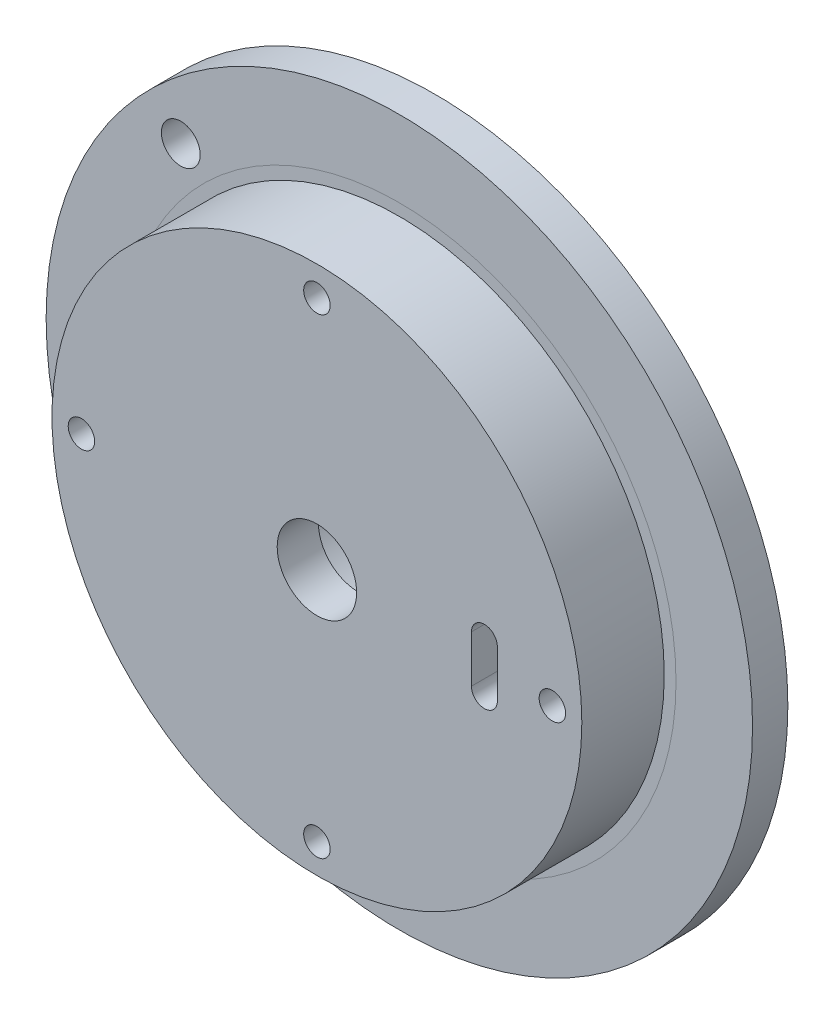
ISO-10303-21;
HEADER;
FILE_DESCRIPTION(('STEP AP214'),'2;1');
FILE_NAME('part.step','',(''),(''),'','','');
FILE_SCHEMA(('AUTOMOTIVE_DESIGN { 1 0 10303 214 1 1 1 1 }'));
ENDSEC;
DATA;
#1=APPLICATION_CONTEXT('core data for automotive mechanical design processes');
#2=APPLICATION_PROTOCOL_DEFINITION('international standard','automotive_design',2000,#1);
#3=PRODUCT_CONTEXT('',#1,'mechanical');
#4=PRODUCT('Part','Part','',(#3));
#5=PRODUCT_RELATED_PRODUCT_CATEGORY('part','',(#4));
#6=PRODUCT_DEFINITION_FORMATION('','',#4);
#7=PRODUCT_DEFINITION_CONTEXT('part definition',#1,'design');
#8=PRODUCT_DEFINITION('design','',#6,#7);
#9=PRODUCT_DEFINITION_SHAPE('','',#8);
#10=(LENGTH_UNIT() NAMED_UNIT(*) SI_UNIT(.MILLI.,.METRE.));
#11=(NAMED_UNIT(*) PLANE_ANGLE_UNIT() SI_UNIT($,.RADIAN.));
#12=(NAMED_UNIT(*) SI_UNIT($,.STERADIAN.) SOLID_ANGLE_UNIT());
#13=UNCERTAINTY_MEASURE_WITH_UNIT(LENGTH_MEASURE(1.E-05),#10,'distance_accuracy_value','');
#14=(GEOMETRIC_REPRESENTATION_CONTEXT(3) GLOBAL_UNCERTAINTY_ASSIGNED_CONTEXT((#13)) GLOBAL_UNIT_ASSIGNED_CONTEXT((#10,
#11,#12)) REPRESENTATION_CONTEXT('',''));
#15=CARTESIAN_POINT('',(0.,0.,0.));
#16=DIRECTION('',(0.,0.,1.));
#17=DIRECTION('',(1.,0.,0.));
#18=AXIS2_PLACEMENT_3D('',#15,#16,#17);
#19=CARTESIAN_POINT('',(0.,0.,13.));
#20=DIRECTION('',(0.,0.,-1.));
#21=DIRECTION('',(-1.,0.,0.));
#22=AXIS2_PLACEMENT_3D('',#19,#20,#21);
#23=PLANE('',#22);
#24=CARTESIAN_POINT('',(0.,0.,13.));
#25=DIRECTION('',(0.,0.,-1.));
#26=DIRECTION('',(-1.,0.,0.));
#27=AXIS2_PLACEMENT_3D('',#24,#25,#26);
#28=CIRCLE('',#27,14.);
#29=CARTESIAN_POINT('',(-14.,0.,13.));
#30=VERTEX_POINT('',#29);
#31=EDGE_CURVE('E123',#30,#30,#28,.T.);
#32=ORIENTED_EDGE('',*,*,#31,.T.);
#33=EDGE_LOOP('',(#32));
#34=FACE_BOUND('',#33,.T.);
#35=CARTESIAN_POINT('',(0.,0.,13.));
#36=DIRECTION('',(0.,0.,-1.));
#37=DIRECTION('',(-1.,0.,0.));
#38=AXIS2_PLACEMENT_3D('',#35,#36,#37);
#39=CIRCLE('',#38,13.5);
#40=CARTESIAN_POINT('',(-13.5,0.,13.));
#41=VERTEX_POINT('',#40);
#42=EDGE_CURVE('E249',#41,#41,#39,.F.);
#43=ORIENTED_EDGE('',*,*,#42,.T.);
#44=EDGE_LOOP('',(#43));
#45=FACE_BOUND('',#44,.T.);
#46=ADVANCED_FACE('F115',(#34,#45),#23,.T.);
#47=CARTESIAN_POINT('',(0.,0.,6.));
#48=DIRECTION('',(0.,0.,1.));
#49=DIRECTION('',(1.,0.,0.));
#50=AXIS2_PLACEMENT_3D('',#47,#48,#49);
#51=PLANE('',#50);
#52=CARTESIAN_POINT('',(0.,0.,6.));
#53=DIRECTION('',(0.,0.,1.));
#54=DIRECTION('',(1.,0.,0.));
#55=AXIS2_PLACEMENT_3D('',#52,#53,#54);
#56=CIRCLE('',#55,60.);
#57=CARTESIAN_POINT('',(60.,0.,6.));
#58=VERTEX_POINT('',#57);
#59=EDGE_CURVE('E229',#58,#58,#56,.T.);
#60=ORIENTED_EDGE('',*,*,#59,.T.);
#61=EDGE_LOOP('',(#60));
#62=FACE_BOUND('',#61,.T.);
#63=CARTESIAN_POINT('',(-37.1231060122937,37.1231060122937,6.));
#64=DIRECTION('',(0.,0.,1.));
#65=DIRECTION('',(1.,0.,0.));
#66=AXIS2_PLACEMENT_3D('',#63,#64,#65);
#67=CIRCLE('',#66,3.29999999999998);
#68=CARTESIAN_POINT('',(-33.8231060122938,37.1231060122937,6.));
#69=VERTEX_POINT('',#68);
#70=EDGE_CURVE('E396',#69,#69,#67,.T.);
#71=ORIENTED_EDGE('',*,*,#70,.F.);
#72=EDGE_LOOP('',(#71));
#73=FACE_BOUND('',#72,.T.);
#74=CARTESIAN_POINT('',(0.,0.,6.));
#75=DIRECTION('',(0.,0.,1.));
#76=DIRECTION('',(1.,0.,0.));
#77=AXIS2_PLACEMENT_3D('',#74,#75,#76);
#78=CIRCLE('',#77,47.);
#79=CARTESIAN_POINT('',(47.,0.,6.));
#80=VERTEX_POINT('',#79);
#81=EDGE_CURVE('E245',#80,#80,#78,.F.);
#82=ORIENTED_EDGE('',*,*,#81,.T.);
#83=EDGE_LOOP('',(#82));
#84=FACE_BOUND('',#83,.T.);
#85=ADVANCED_FACE('F268',(#62,#73,#84),#51,.T.);
#86=CARTESIAN_POINT('',(0.,0.,0.));
#87=DIRECTION('',(0.,0.,-1.));
#88=DIRECTION('',(-1.,0.,0.));
#89=AXIS2_PLACEMENT_3D('',#86,#87,#88);
#90=CYLINDRICAL_SURFACE('',#89,6.75);
#91=CARTESIAN_POINT('',(0.,0.,20.));
#92=DIRECTION('',(0.,0.,-1.));
#93=DIRECTION('',(-1.,0.,0.));
#94=AXIS2_PLACEMENT_3D('',#91,#92,#93);
#95=CIRCLE('',#94,6.75);
#96=CARTESIAN_POINT('',(-6.75,0.,20.));
#97=VERTEX_POINT('',#96);
#98=EDGE_CURVE('E238',#97,#97,#95,.T.);
#99=ORIENTED_EDGE('',*,*,#98,.F.);
#100=EDGE_LOOP('',(#99));
#101=FACE_BOUND('',#100,.T.);
#102=CARTESIAN_POINT('',(0.,0.,13.));
#103=DIRECTION('',(0.,0.,-1.));
#104=DIRECTION('',(-1.,0.,0.));
#105=AXIS2_PLACEMENT_3D('',#102,#103,#104);
#106=CIRCLE('',#105,6.75);
#107=CARTESIAN_POINT('',(-6.75,0.,13.));
#108=VERTEX_POINT('',#107);
#109=EDGE_CURVE('E235',#108,#108,#106,.F.);
#110=ORIENTED_EDGE('',*,*,#109,.F.);
#111=EDGE_LOOP('',(#110));
#112=FACE_BOUND('',#111,.T.);
#113=ADVANCED_FACE('F274',(#101,#112),#90,.F.);
#114=CARTESIAN_POINT('',(0.,0.,20.));
#115=DIRECTION('',(0.,0.,1.));
#116=DIRECTION('',(1.,0.,0.));
#117=AXIS2_PLACEMENT_3D('',#114,#115,#116);
#118=PLANE('',#117);
#119=ORIENTED_EDGE('',*,*,#98,.T.);
#120=EDGE_LOOP('',(#119));
#121=FACE_BOUND('',#120,.T.);
#122=CARTESIAN_POINT('',(0.,40.,20.));
#123=DIRECTION('',(0.,0.,-1.));
#124=DIRECTION('',(-1.,0.,0.));
#125=AXIS2_PLACEMENT_3D('',#122,#123,#124);
#126=CIRCLE('',#125,2.25);
#127=CARTESIAN_POINT('',(-2.25,40.,20.));
#128=VERTEX_POINT('',#127);
#129=EDGE_CURVE('E192',#128,#128,#126,.T.);
#130=ORIENTED_EDGE('',*,*,#129,.T.);
#131=EDGE_LOOP('',(#130));
#132=FACE_BOUND('',#131,.T.);
#133=CARTESIAN_POINT('',(-40.,0.,20.));
#134=DIRECTION('',(0.,0.,-1.));
#135=DIRECTION('',(-1.,0.,0.));
#136=AXIS2_PLACEMENT_3D('',#133,#134,#135);
#137=CIRCLE('',#136,2.25);
#138=CARTESIAN_POINT('',(-42.25,0.,20.));
#139=VERTEX_POINT('',#138);
#140=EDGE_CURVE('E201',#139,#139,#137,.T.);
#141=ORIENTED_EDGE('',*,*,#140,.T.);
#142=EDGE_LOOP('',(#141));
#143=FACE_BOUND('',#142,.T.);
#144=CARTESIAN_POINT('',(0.,-40.,20.));
#145=DIRECTION('',(0.,0.,-1.));
#146=DIRECTION('',(-1.,0.,0.));
#147=AXIS2_PLACEMENT_3D('',#144,#145,#146);
#148=CIRCLE('',#147,2.25);
#149=CARTESIAN_POINT('',(-2.25,-40.,20.));
#150=VERTEX_POINT('',#149);
#151=EDGE_CURVE('E210',#150,#150,#148,.T.);
#152=ORIENTED_EDGE('',*,*,#151,.T.);
#153=EDGE_LOOP('',(#152));
#154=FACE_BOUND('',#153,.T.);
#155=CARTESIAN_POINT('',(40.,0.,20.));
#156=DIRECTION('',(0.,0.,-1.));
#157=DIRECTION('',(-1.,0.,0.));
#158=AXIS2_PLACEMENT_3D('',#155,#156,#157);
#159=CIRCLE('',#158,2.25);
#160=CARTESIAN_POINT('',(37.75,0.,20.));
#161=VERTEX_POINT('',#160);
#162=EDGE_CURVE('E219',#161,#161,#159,.T.);
#163=ORIENTED_EDGE('',*,*,#162,.T.);
#164=EDGE_LOOP('',(#163));
#165=FACE_BOUND('',#164,.T.);
#166=CARTESIAN_POINT('',(0.,0.,20.));
#167=DIRECTION('',(0.,0.,1.));
#168=DIRECTION('',(1.,0.,0.));
#169=AXIS2_PLACEMENT_3D('',#166,#167,#168);
#170=CIRCLE('',#169,45.);
#171=CARTESIAN_POINT('',(45.,0.,20.));
#172=VERTEX_POINT('',#171);
#173=EDGE_CURVE('E222',#172,#172,#170,.T.);
#174=ORIENTED_EDGE('',*,*,#173,.T.);
#175=EDGE_LOOP('',(#174));
#176=FACE_BOUND('',#175,.T.);
#177=DIRECTION('',(0.,1.,0.));
#178=VECTOR('',#177,1.);
#179=CARTESIAN_POINT('',(26.2506410802858,-4.,20.));
#180=LINE('',#179,#178);
#181=CARTESIAN_POINT('',(26.2506410802858,-4.,20.));
#182=VERTEX_POINT('',#181);
#183=CARTESIAN_POINT('',(26.2506410802858,4.,20.));
#184=VERTEX_POINT('',#183);
#185=EDGE_CURVE('E154',#182,#184,#180,.T.);
#186=ORIENTED_EDGE('',*,*,#185,.T.);
#187=CARTESIAN_POINT('',(28.4506410802858,4.,20.));
#188=DIRECTION('',(0.,0.,-1.));
#189=DIRECTION('',(-1.,0.,0.));
#190=AXIS2_PLACEMENT_3D('',#187,#188,#189);
#191=CIRCLE('',#190,2.19999999999999);
#192=CARTESIAN_POINT('',(30.6506410802858,4.,20.));
#193=VERTEX_POINT('',#192);
#194=EDGE_CURVE('E183',#184,#193,#191,.T.);
#195=ORIENTED_EDGE('',*,*,#194,.T.);
#196=DIRECTION('',(0.,1.,0.));
#197=VECTOR('',#196,1.);
#198=CARTESIAN_POINT('',(30.6506410802858,-4.,20.));
#199=LINE('',#198,#197);
#200=CARTESIAN_POINT('',(30.6506410802858,-4.,20.));
#201=VERTEX_POINT('',#200);
#202=EDGE_CURVE('E164',#201,#193,#199,.T.);
#203=ORIENTED_EDGE('',*,*,#202,.F.);
#204=CARTESIAN_POINT('',(28.4506410802858,-4.,20.));
#205=DIRECTION('',(0.,0.,-1.));
#206=DIRECTION('',(-1.,0.,0.));
#207=AXIS2_PLACEMENT_3D('',#204,#205,#206);
#208=CIRCLE('',#207,2.19999999999999);
#209=EDGE_CURVE('E168',#201,#182,#208,.T.);
#210=ORIENTED_EDGE('',*,*,#209,.T.);
#211=EDGE_LOOP('',(#186,#195,#203,#210));
#212=FACE_BOUND('',#211,.T.);
#213=ADVANCED_FACE('F175',(#121,#132,#143,#154,#165,#176,#212),#118,.T.);
#214=CARTESIAN_POINT('',(0.,0.,6.));
#215=DIRECTION('',(0.,0.,-1.));
#216=DIRECTION('',(-1.,0.,0.));
#217=AXIS2_PLACEMENT_3D('',#214,#215,#216);
#218=CYLINDRICAL_SURFACE('',#217,60.);
#219=CARTESIAN_POINT('',(0.,0.,0.));
#220=DIRECTION('',(0.,0.,1.));
#221=DIRECTION('',(1.,0.,0.));
#222=AXIS2_PLACEMENT_3D('',#219,#220,#221);
#223=CIRCLE('',#222,60.);
#224=CARTESIAN_POINT('',(60.,0.,0.));
#225=VERTEX_POINT('',#224);
#226=EDGE_CURVE('E228',#225,#225,#223,.T.);
#227=ORIENTED_EDGE('',*,*,#226,.T.);
#228=EDGE_LOOP('',(#227));
#229=FACE_BOUND('',#228,.T.);
#230=ORIENTED_EDGE('',*,*,#59,.F.);
#231=EDGE_LOOP('',(#230));
#232=FACE_BOUND('',#231,.T.);
#233=ADVANCED_FACE('F302',(#229,#232),#218,.T.);
#234=ORIENTED_EDGE('',*,*,#81,.F.);
#235=EDGE_LOOP('',(#234));
#236=FACE_BOUND('',#235,.T.);
#237=CARTESIAN_POINT('',(0.,0.,6.));
#238=DIRECTION('',(0.,0.,1.));
#239=DIRECTION('',(1.,0.,0.));
#240=AXIS2_PLACEMENT_3D('',#237,#238,#239);
#241=CIRCLE('',#240,45.);
#242=CARTESIAN_POINT('',(45.,0.,6.));
#243=VERTEX_POINT('',#242);
#244=EDGE_CURVE('E225',#243,#243,#241,.F.);
#245=ORIENTED_EDGE('',*,*,#244,.T.);
#246=EDGE_LOOP('',(#245));
#247=FACE_BOUND('',#246,.T.);
#248=ADVANCED_FACE('F277',(#236,#247),#51,.T.);
#249=CARTESIAN_POINT('',(0.,0.,0.));
#250=DIRECTION('',(0.,0.,1.));
#251=DIRECTION('',(1.,0.,0.));
#252=AXIS2_PLACEMENT_3D('',#249,#250,#251);
#253=PLANE('',#252);
#254=CARTESIAN_POINT('',(-23.6415128294988,-24.9493401738382,0.));
#255=DIRECTION('',(0.,0.,1.));
#256=DIRECTION('',(1.,0.,0.));
#257=AXIS2_PLACEMENT_3D('',#254,#255,#256);
#258=CIRCLE('',#257,5.);
#259=CARTESIAN_POINT('',(-18.6415128294988,-24.9493401738382,0.));
#260=VERTEX_POINT('',#259);
#261=EDGE_CURVE('E239',#260,#260,#258,.T.);
#262=ORIENTED_EDGE('',*,*,#261,.T.);
#263=EDGE_LOOP('',(#262));
#264=FACE_BOUND('',#263,.T.);
#265=CARTESIAN_POINT('',(0.,0.,0.));
#266=DIRECTION('',(0.,0.,1.));
#267=DIRECTION('',(1.,0.,0.));
#268=AXIS2_PLACEMENT_3D('',#265,#266,#267);
#269=CIRCLE('',#268,18.);
#270=CARTESIAN_POINT('',(18.,0.,0.));
#271=VERTEX_POINT('',#270);
#272=EDGE_CURVE('E242',#271,#271,#269,.T.);
#273=ORIENTED_EDGE('',*,*,#272,.T.);
#274=EDGE_LOOP('',(#273));
#275=FACE_BOUND('',#274,.T.);
#276=CARTESIAN_POINT('',(-37.1231060122937,37.1231060122937,0.));
#277=DIRECTION('',(0.,0.,1.));
#278=DIRECTION('',(1.,0.,0.));
#279=AXIS2_PLACEMENT_3D('',#276,#277,#278);
#280=CIRCLE('',#279,3.3);
#281=CARTESIAN_POINT('',(-33.8231060122937,37.1231060122937,0.));
#282=VERTEX_POINT('',#281);
#283=EDGE_CURVE('E377',#282,#282,#280,.T.);
#284=ORIENTED_EDGE('',*,*,#283,.T.);
#285=EDGE_LOOP('',(#284));
#286=FACE_BOUND('',#285,.T.);
#287=CARTESIAN_POINT('',(28.4506410802858,4.,0.));
#288=DIRECTION('',(0.,0.,-1.));
#289=DIRECTION('',(-1.,0.,0.));
#290=AXIS2_PLACEMENT_3D('',#287,#288,#289);
#291=CIRCLE('',#290,2.19999999999999);
#292=CARTESIAN_POINT('',(26.2506410802858,4.,0.));
#293=VERTEX_POINT('',#292);
#294=CARTESIAN_POINT('',(30.6506410802858,4.,0.));
#295=VERTEX_POINT('',#294);
#296=EDGE_CURVE('E181',#293,#295,#291,.T.);
#297=ORIENTED_EDGE('',*,*,#296,.F.);
#298=DIRECTION('',(0.,1.,0.));
#299=VECTOR('',#298,1.);
#300=CARTESIAN_POINT('',(26.2506410802858,-4.,0.));
#301=LINE('',#300,#299);
#302=CARTESIAN_POINT('',(26.2506410802858,-4.,0.));
#303=VERTEX_POINT('',#302);
#304=EDGE_CURVE('E165',#303,#293,#301,.T.);
#305=ORIENTED_EDGE('',*,*,#304,.F.);
#306=CARTESIAN_POINT('',(28.4506410802858,-4.,0.));
#307=DIRECTION('',(0.,0.,-1.));
#308=DIRECTION('',(-1.,0.,0.));
#309=AXIS2_PLACEMENT_3D('',#306,#307,#308);
#310=CIRCLE('',#309,2.19999999999999);
#311=CARTESIAN_POINT('',(30.6506410802858,-4.,0.));
#312=VERTEX_POINT('',#311);
#313=EDGE_CURVE('E171',#312,#303,#310,.T.);
#314=ORIENTED_EDGE('',*,*,#313,.F.);
#315=DIRECTION('',(0.,1.,0.));
#316=VECTOR('',#315,1.);
#317=CARTESIAN_POINT('',(30.6506410802858,-4.,0.));
#318=LINE('',#317,#316);
#319=EDGE_CURVE('E412',#312,#295,#318,.T.);
#320=ORIENTED_EDGE('',*,*,#319,.T.);
#321=EDGE_LOOP('',(#297,#305,#314,#320));
#322=FACE_BOUND('',#321,.T.);
#323=CARTESIAN_POINT('',(0.,40.,0.));
#324=DIRECTION('',(0.,0.,-1.));
#325=DIRECTION('',(-1.,0.,0.));
#326=AXIS2_PLACEMENT_3D('',#323,#324,#325);
#327=CIRCLE('',#326,2.425);
#328=CARTESIAN_POINT('',(-2.425,40.,0.));
#329=VERTEX_POINT('',#328);
#330=EDGE_CURVE('E186',#329,#329,#327,.T.);
#331=ORIENTED_EDGE('',*,*,#330,.F.);
#332=EDGE_LOOP('',(#331));
#333=FACE_BOUND('',#332,.T.);
#334=CARTESIAN_POINT('',(-40.,0.,0.));
#335=DIRECTION('',(0.,0.,-1.));
#336=DIRECTION('',(-1.,0.,0.));
#337=AXIS2_PLACEMENT_3D('',#334,#335,#336);
#338=CIRCLE('',#337,2.425);
#339=CARTESIAN_POINT('',(-42.425,0.,0.));
#340=VERTEX_POINT('',#339);
#341=EDGE_CURVE('E195',#340,#340,#338,.T.);
#342=ORIENTED_EDGE('',*,*,#341,.F.);
#343=EDGE_LOOP('',(#342));
#344=FACE_BOUND('',#343,.T.);
#345=CARTESIAN_POINT('',(0.,-40.,0.));
#346=DIRECTION('',(0.,0.,-1.));
#347=DIRECTION('',(-1.,0.,0.));
#348=AXIS2_PLACEMENT_3D('',#345,#346,#347);
#349=CIRCLE('',#348,2.425);
#350=CARTESIAN_POINT('',(-2.425,-40.,0.));
#351=VERTEX_POINT('',#350);
#352=EDGE_CURVE('E204',#351,#351,#349,.T.);
#353=ORIENTED_EDGE('',*,*,#352,.F.);
#354=EDGE_LOOP('',(#353));
#355=FACE_BOUND('',#354,.T.);
#356=CARTESIAN_POINT('',(40.,0.,0.));
#357=DIRECTION('',(0.,0.,-1.));
#358=DIRECTION('',(-1.,0.,0.));
#359=AXIS2_PLACEMENT_3D('',#356,#357,#358);
#360=CIRCLE('',#359,2.425);
#361=CARTESIAN_POINT('',(37.575,0.,0.));
#362=VERTEX_POINT('',#361);
#363=EDGE_CURVE('E213',#362,#362,#360,.T.);
#364=ORIENTED_EDGE('',*,*,#363,.F.);
#365=EDGE_LOOP('',(#364));
#366=FACE_BOUND('',#365,.T.);
#367=ORIENTED_EDGE('',*,*,#226,.F.);
#368=EDGE_LOOP('',(#367));
#369=FACE_BOUND('',#368,.T.);
#370=ADVANCED_FACE('F352',(#264,#275,#286,#322,#333,#344,#355,#366,#369),#253,.F.);
#371=CARTESIAN_POINT('',(0.,0.,20.));
#372=DIRECTION('',(0.,0.,-1.));
#373=DIRECTION('',(-1.,0.,0.));
#374=AXIS2_PLACEMENT_3D('',#371,#372,#373);
#375=CYLINDRICAL_SURFACE('',#374,45.);
#376=ORIENTED_EDGE('',*,*,#244,.F.);
#377=EDGE_LOOP('',(#376));
#378=FACE_BOUND('',#377,.T.);
#379=ORIENTED_EDGE('',*,*,#173,.F.);
#380=EDGE_LOOP('',(#379));
#381=FACE_BOUND('',#380,.T.);
#382=ADVANCED_FACE('F348',(#378,#381),#375,.T.);
#383=CARTESIAN_POINT('',(40.,0.,0.));
#384=DIRECTION('',(0.,0.,-1.));
#385=DIRECTION('',(-1.,0.,0.));
#386=AXIS2_PLACEMENT_3D('',#383,#384,#385);
#387=CYLINDRICAL_SURFACE('',#386,2.24999999999999);
#388=ORIENTED_EDGE('',*,*,#162,.F.);
#389=EDGE_LOOP('',(#388));
#390=FACE_BOUND('',#389,.T.);
#391=CARTESIAN_POINT('',(40.,0.,0.175000000000008));
#392=DIRECTION('',(0.,0.,-1.));
#393=DIRECTION('',(-1.,0.,0.));
#394=AXIS2_PLACEMENT_3D('',#391,#392,#393);
#395=CIRCLE('',#394,2.24999999999999);
#396=CARTESIAN_POINT('',(37.75,0.,0.175000000000008));
#397=VERTEX_POINT('',#396);
#398=EDGE_CURVE('E216',#397,#397,#395,.T.);
#399=ORIENTED_EDGE('',*,*,#398,.T.);
#400=EDGE_LOOP('',(#399));
#401=FACE_BOUND('',#400,.T.);
#402=ADVANCED_FACE('F345',(#390,#401),#387,.F.);
#403=CARTESIAN_POINT('',(40.,0.,0.));
#404=DIRECTION('',(0.,0.,-1.));
#405=DIRECTION('',(-1.,0.,0.));
#406=AXIS2_PLACEMENT_3D('',#403,#404,#405);
#407=CONICAL_SURFACE('',#406,2.425,0.785398163397463);
#408=ORIENTED_EDGE('',*,*,#398,.F.);
#409=EDGE_LOOP('',(#408));
#410=FACE_BOUND('',#409,.T.);
#411=ORIENTED_EDGE('',*,*,#363,.T.);
#412=EDGE_LOOP('',(#411));
#413=FACE_BOUND('',#412,.T.);
#414=ADVANCED_FACE('F341',(#410,#413),#407,.F.);
#415=CARTESIAN_POINT('',(0.,-40.,0.));
#416=DIRECTION('',(0.,0.,-1.));
#417=DIRECTION('',(-1.,0.,0.));
#418=AXIS2_PLACEMENT_3D('',#415,#416,#417);
#419=CYLINDRICAL_SURFACE('',#418,2.24999999999999);
#420=ORIENTED_EDGE('',*,*,#151,.F.);
#421=EDGE_LOOP('',(#420));
#422=FACE_BOUND('',#421,.T.);
#423=CARTESIAN_POINT('',(0.,-40.,0.175000000000008));
#424=DIRECTION('',(0.,0.,-1.));
#425=DIRECTION('',(-1.,0.,0.));
#426=AXIS2_PLACEMENT_3D('',#423,#424,#425);
#427=CIRCLE('',#426,2.24999999999999);
#428=CARTESIAN_POINT('',(-2.24999999999999,-40.,0.175000000000008));
#429=VERTEX_POINT('',#428);
#430=EDGE_CURVE('E207',#429,#429,#427,.T.);
#431=ORIENTED_EDGE('',*,*,#430,.T.);
#432=EDGE_LOOP('',(#431));
#433=FACE_BOUND('',#432,.T.);
#434=ADVANCED_FACE('F337',(#422,#433),#419,.F.);
#435=CARTESIAN_POINT('',(0.,-40.,0.));
#436=DIRECTION('',(0.,0.,-1.));
#437=DIRECTION('',(-1.,0.,0.));
#438=AXIS2_PLACEMENT_3D('',#435,#436,#437);
#439=CONICAL_SURFACE('',#438,2.425,0.785398163397453);
#440=ORIENTED_EDGE('',*,*,#430,.F.);
#441=EDGE_LOOP('',(#440));
#442=FACE_BOUND('',#441,.T.);
#443=ORIENTED_EDGE('',*,*,#352,.T.);
#444=EDGE_LOOP('',(#443));
#445=FACE_BOUND('',#444,.T.);
#446=ADVANCED_FACE('F333',(#442,#445),#439,.F.);
#447=CARTESIAN_POINT('',(-40.,0.,0.));
#448=DIRECTION('',(0.,0.,-1.));
#449=DIRECTION('',(-1.,0.,0.));
#450=AXIS2_PLACEMENT_3D('',#447,#448,#449);
#451=CYLINDRICAL_SURFACE('',#450,2.24999999999999);
#452=ORIENTED_EDGE('',*,*,#140,.F.);
#453=EDGE_LOOP('',(#452));
#454=FACE_BOUND('',#453,.T.);
#455=CARTESIAN_POINT('',(-40.,0.,0.175000000000008));
#456=DIRECTION('',(0.,0.,-1.));
#457=DIRECTION('',(-1.,0.,0.));
#458=AXIS2_PLACEMENT_3D('',#455,#456,#457);
#459=CIRCLE('',#458,2.24999999999999);
#460=CARTESIAN_POINT('',(-42.25,0.,0.175000000000008));
#461=VERTEX_POINT('',#460);
#462=EDGE_CURVE('E198',#461,#461,#459,.T.);
#463=ORIENTED_EDGE('',*,*,#462,.T.);
#464=EDGE_LOOP('',(#463));
#465=FACE_BOUND('',#464,.T.);
#466=ADVANCED_FACE('F329',(#454,#465),#451,.F.);
#467=CARTESIAN_POINT('',(-40.,0.,0.));
#468=DIRECTION('',(0.,0.,-1.));
#469=DIRECTION('',(-1.,0.,0.));
#470=AXIS2_PLACEMENT_3D('',#467,#468,#469);
#471=CONICAL_SURFACE('',#470,2.425,0.785398163397463);
#472=ORIENTED_EDGE('',*,*,#462,.F.);
#473=EDGE_LOOP('',(#472));
#474=FACE_BOUND('',#473,.T.);
#475=ORIENTED_EDGE('',*,*,#341,.T.);
#476=EDGE_LOOP('',(#475));
#477=FACE_BOUND('',#476,.T.);
#478=ADVANCED_FACE('F325',(#474,#477),#471,.F.);
#479=CARTESIAN_POINT('',(0.,40.,0.));
#480=DIRECTION('',(0.,0.,-1.));
#481=DIRECTION('',(-1.,0.,0.));
#482=AXIS2_PLACEMENT_3D('',#479,#480,#481);
#483=CYLINDRICAL_SURFACE('',#482,2.24999999999999);
#484=ORIENTED_EDGE('',*,*,#129,.F.);
#485=EDGE_LOOP('',(#484));
#486=FACE_BOUND('',#485,.T.);
#487=CARTESIAN_POINT('',(0.,40.,0.175000000000008));
#488=DIRECTION('',(0.,0.,-1.));
#489=DIRECTION('',(-1.,0.,0.));
#490=AXIS2_PLACEMENT_3D('',#487,#488,#489);
#491=CIRCLE('',#490,2.24999999999999);
#492=CARTESIAN_POINT('',(-2.24999999999999,40.,0.175000000000008));
#493=VERTEX_POINT('',#492);
#494=EDGE_CURVE('E189',#493,#493,#491,.T.);
#495=ORIENTED_EDGE('',*,*,#494,.T.);
#496=EDGE_LOOP('',(#495));
#497=FACE_BOUND('',#496,.T.);
#498=ADVANCED_FACE('F321',(#486,#497),#483,.F.);
#499=CARTESIAN_POINT('',(0.,40.,0.));
#500=DIRECTION('',(0.,0.,-1.));
#501=DIRECTION('',(-1.,0.,0.));
#502=AXIS2_PLACEMENT_3D('',#499,#500,#501);
#503=CONICAL_SURFACE('',#502,2.425,0.785398163397453);
#504=ORIENTED_EDGE('',*,*,#494,.F.);
#505=EDGE_LOOP('',(#504));
#506=FACE_BOUND('',#505,.T.);
#507=ORIENTED_EDGE('',*,*,#330,.T.);
#508=EDGE_LOOP('',(#507));
#509=FACE_BOUND('',#508,.T.);
#510=ADVANCED_FACE('F317',(#506,#509),#503,.F.);
#511=CARTESIAN_POINT('',(28.4506410802858,4.,0.));
#512=DIRECTION('',(0.,0.,-1.));
#513=DIRECTION('',(-1.,0.,0.));
#514=AXIS2_PLACEMENT_3D('',#511,#512,#513);
#515=CYLINDRICAL_SURFACE('',#514,2.19999999999999);
#516=ORIENTED_EDGE('',*,*,#296,.T.);
#517=DIRECTION('',(0.,0.,1.));
#518=VECTOR('',#517,1.);
#519=CARTESIAN_POINT('',(30.6506410802858,4.,20.));
#520=LINE('',#519,#518);
#521=EDGE_CURVE('E173',#295,#193,#520,.T.);
#522=ORIENTED_EDGE('',*,*,#521,.T.);
#523=ORIENTED_EDGE('',*,*,#194,.F.);
#524=DIRECTION('',(0.,0.,-1.));
#525=VECTOR('',#524,1.);
#526=CARTESIAN_POINT('',(26.2506410802858,4.,0.));
#527=LINE('',#526,#525);
#528=EDGE_CURVE('E159',#293,#184,#527,.F.);
#529=ORIENTED_EDGE('',*,*,#528,.F.);
#530=EDGE_LOOP('',(#516,#522,#523,#529));
#531=FACE_BOUND('',#530,.T.);
#532=ADVANCED_FACE('F314',(#531),#515,.F.);
#533=CARTESIAN_POINT('',(28.4506410802858,-4.,0.));
#534=DIRECTION('',(0.,0.,-1.));
#535=DIRECTION('',(-1.,0.,0.));
#536=AXIS2_PLACEMENT_3D('',#533,#534,#535);
#537=CYLINDRICAL_SURFACE('',#536,2.19999999999999);
#538=ORIENTED_EDGE('',*,*,#209,.F.);
#539=DIRECTION('',(0.,0.,1.));
#540=VECTOR('',#539,1.);
#541=CARTESIAN_POINT('',(30.6506410802858,-4.,20.));
#542=LINE('',#541,#540);
#543=EDGE_CURVE('E130',#312,#201,#542,.T.);
#544=ORIENTED_EDGE('',*,*,#543,.F.);
#545=ORIENTED_EDGE('',*,*,#313,.T.);
#546=DIRECTION('',(0.,0.,-1.));
#547=VECTOR('',#546,1.);
#548=CARTESIAN_POINT('',(26.2506410802858,-4.,0.));
#549=LINE('',#548,#547);
#550=EDGE_CURVE('E157',#182,#303,#549,.T.);
#551=ORIENTED_EDGE('',*,*,#550,.F.);
#552=EDGE_LOOP('',(#538,#544,#545,#551));
#553=FACE_BOUND('',#552,.T.);
#554=ADVANCED_FACE('F167',(#553),#537,.F.);
#555=CARTESIAN_POINT('',(30.6506410802858,-4.,20.));
#556=DIRECTION('',(-1.,0.,0.));
#557=DIRECTION('',(0.,0.,1.));
#558=AXIS2_PLACEMENT_3D('',#555,#556,#557);
#559=PLANE('',#558);
#560=ORIENTED_EDGE('',*,*,#521,.F.);
#561=ORIENTED_EDGE('',*,*,#319,.F.);
#562=ORIENTED_EDGE('',*,*,#543,.T.);
#563=ORIENTED_EDGE('',*,*,#202,.T.);
#564=EDGE_LOOP('',(#560,#561,#562,#563));
#565=FACE_BOUND('',#564,.T.);
#566=ADVANCED_FACE('F309',(#565),#559,.T.);
#567=CARTESIAN_POINT('',(26.2506410802858,-4.,0.));
#568=DIRECTION('',(-1.,0.,0.));
#569=DIRECTION('',(0.,0.,1.));
#570=AXIS2_PLACEMENT_3D('',#567,#568,#569);
#571=PLANE('',#570);
#572=ORIENTED_EDGE('',*,*,#528,.T.);
#573=ORIENTED_EDGE('',*,*,#185,.F.);
#574=ORIENTED_EDGE('',*,*,#550,.T.);
#575=ORIENTED_EDGE('',*,*,#304,.T.);
#576=EDGE_LOOP('',(#572,#573,#574,#575));
#577=FACE_BOUND('',#576,.T.);
#578=ADVANCED_FACE('F156',(#577),#571,.F.);
#579=CARTESIAN_POINT('',(-37.1231060122937,37.1231060122937,6.));
#580=DIRECTION('',(0.,0.,1.));
#581=DIRECTION('',(1.,0.,0.));
#582=AXIS2_PLACEMENT_3D('',#579,#580,#581);
#583=CYLINDRICAL_SURFACE('',#582,3.29999999999999);
#584=ORIENTED_EDGE('',*,*,#283,.F.);
#585=EDGE_LOOP('',(#584));
#586=FACE_BOUND('',#585,.T.);
#587=ORIENTED_EDGE('',*,*,#70,.T.);
#588=EDGE_LOOP('',(#587));
#589=FACE_BOUND('',#588,.T.);
#590=ADVANCED_FACE('F282',(#586,#589),#583,.F.);
#591=ORIENTED_EDGE('',*,*,#42,.F.);
#592=EDGE_LOOP('',(#591));
#593=FACE_BOUND('',#592,.T.);
#594=ORIENTED_EDGE('',*,*,#109,.T.);
#595=EDGE_LOOP('',(#594));
#596=FACE_BOUND('',#595,.T.);
#597=ADVANCED_FACE('F270',(#593,#596),#23,.T.);
#598=CARTESIAN_POINT('',(0.,0.,13.));
#599=DIRECTION('',(0.,0.,-1.));
#600=DIRECTION('',(-1.,0.,0.));
#601=AXIS2_PLACEMENT_3D('',#598,#599,#600);
#602=CYLINDRICAL_SURFACE('',#601,16.);
#603=CARTESIAN_POINT('',(0.,0.,11.));
#604=DIRECTION('',(0.,0.,-1.));
#605=DIRECTION('',(-1.,0.,0.));
#606=AXIS2_PLACEMENT_3D('',#603,#604,#605);
#607=CIRCLE('',#606,16.);
#608=CARTESIAN_POINT('',(-16.,0.,11.));
#609=VERTEX_POINT('',#608);
#610=EDGE_CURVE('E13',#609,#609,#607,.F.);
#611=CARTESIAN_POINT('',(0.,0.,2.));
#612=DIRECTION('',(0.,0.,1.));
#613=DIRECTION('',(1.,0.,0.));
#614=AXIS2_PLACEMENT_3D('',#611,#612,#613);
#615=CIRCLE('',#614,16.);
#616=CARTESIAN_POINT('',(-16.,0.,2.));
#617=VERTEX_POINT('',#616);
#618=EDGE_CURVE('E232',#617,#617,#615,.F.);
#619=CARTESIAN_POINT('',(-16.,0.,11.));
#620=CARTESIAN_POINT('',(-16.,0.,10.90625));
#621=CARTESIAN_POINT('',(-16.,0.,10.8125));
#622=CARTESIAN_POINT('',(-16.,0.,10.625));
#623=CARTESIAN_POINT('',(-16.,0.,10.53125));
#624=CARTESIAN_POINT('',(-16.,0.,10.34375));
#625=CARTESIAN_POINT('',(-16.,0.,10.25));
#626=CARTESIAN_POINT('',(-16.,0.,10.0625));
#627=CARTESIAN_POINT('',(-16.,0.,9.96875));
#628=CARTESIAN_POINT('',(-16.,0.,9.78125));
#629=CARTESIAN_POINT('',(-16.,0.,9.6875));
#630=CARTESIAN_POINT('',(-16.,0.,9.5));
#631=CARTESIAN_POINT('',(-16.,0.,9.40625));
#632=CARTESIAN_POINT('',(-16.,0.,9.21875));
#633=CARTESIAN_POINT('',(-16.,0.,9.125));
#634=CARTESIAN_POINT('',(-16.,0.,8.9375));
#635=CARTESIAN_POINT('',(-16.,0.,8.84375));
#636=CARTESIAN_POINT('',(-16.,0.,8.65625));
#637=CARTESIAN_POINT('',(-16.,0.,8.5625));
#638=CARTESIAN_POINT('',(-16.,0.,8.375));
#639=CARTESIAN_POINT('',(-16.,0.,8.28125));
#640=CARTESIAN_POINT('',(-16.,0.,8.09375));
#641=CARTESIAN_POINT('',(-16.,0.,8.));
#642=CARTESIAN_POINT('',(-16.,0.,7.8125));
#643=CARTESIAN_POINT('',(-16.,0.,7.71875));
#644=CARTESIAN_POINT('',(-16.,0.,7.53125));
#645=CARTESIAN_POINT('',(-16.,0.,7.4375));
#646=CARTESIAN_POINT('',(-16.,0.,7.25));
#647=CARTESIAN_POINT('',(-16.,0.,7.15625));
#648=CARTESIAN_POINT('',(-16.,0.,6.96875));
#649=CARTESIAN_POINT('',(-16.,0.,6.875));
#650=CARTESIAN_POINT('',(-16.,0.,6.6875));
#651=CARTESIAN_POINT('',(-16.,0.,6.59375));
#652=CARTESIAN_POINT('',(-16.,0.,6.40625));
#653=CARTESIAN_POINT('',(-16.,0.,6.3125));
#654=CARTESIAN_POINT('',(-16.,0.,6.125));
#655=CARTESIAN_POINT('',(-16.,0.,6.03125));
#656=CARTESIAN_POINT('',(-16.,0.,5.84375));
#657=CARTESIAN_POINT('',(-16.,0.,5.75));
#658=CARTESIAN_POINT('',(-16.,0.,5.5625));
#659=CARTESIAN_POINT('',(-16.,0.,5.46875));
#660=CARTESIAN_POINT('',(-16.,0.,5.28125));
#661=CARTESIAN_POINT('',(-16.,0.,5.1875));
#662=CARTESIAN_POINT('',(-16.,0.,5.));
#663=CARTESIAN_POINT('',(-16.,0.,4.90625));
#664=CARTESIAN_POINT('',(-16.,0.,4.71875));
#665=CARTESIAN_POINT('',(-16.,0.,4.625));
#666=CARTESIAN_POINT('',(-16.,0.,4.4375));
#667=CARTESIAN_POINT('',(-16.,0.,4.34375));
#668=CARTESIAN_POINT('',(-16.,0.,4.15625));
#669=CARTESIAN_POINT('',(-16.,0.,4.0625));
#670=CARTESIAN_POINT('',(-16.,0.,3.875));
#671=CARTESIAN_POINT('',(-16.,0.,3.78125));
#672=CARTESIAN_POINT('',(-16.,0.,3.59375));
#673=CARTESIAN_POINT('',(-16.,0.,3.5));
#674=CARTESIAN_POINT('',(-16.,0.,3.3125));
#675=CARTESIAN_POINT('',(-16.,0.,3.21875));
#676=CARTESIAN_POINT('',(-16.,0.,3.03125));
#677=CARTESIAN_POINT('',(-16.,0.,2.9375));
#678=CARTESIAN_POINT('',(-16.,0.,2.75));
#679=CARTESIAN_POINT('',(-16.,0.,2.65625));
#680=CARTESIAN_POINT('',(-16.,0.,2.46875));
#681=CARTESIAN_POINT('',(-16.,0.,2.375));
#682=CARTESIAN_POINT('',(-16.,0.,2.1875));
#683=CARTESIAN_POINT('',(-16.,0.,2.09375));
#684=CARTESIAN_POINT('',(-16.,0.,2.));
#685=B_SPLINE_CURVE_WITH_KNOTS('',3,(#619,#620,#621,#622,#623,#624,#625,#626,#627,#628,#629,
#630,#631,#632,#633,#634,#635,#636,#637,#638,#639,#640,#641,#642,#643,#644,#645,#646,#647,#648,
#649,#650,#651,#652,#653,#654,#655,#656,#657,#658,#659,#660,#661,#662,#663,#664,#665,#666,#667,
#668,#669,#670,#671,#672,#673,#674,#675,#676,#677,#678,#679,#680,#681,#682,#683,#684),
.UNSPECIFIED.,.F.,.F.,(4,2,2,2,2,2,2,2,2,2,2,2,2,2,2,2,2,2,2,2,2,2,2,2,2,2,2,2,2,2,2,2,4),(0.,
0.28125,0.5625,0.843750000000001,1.125,1.40625,1.6875,1.96875,2.25,2.53125,2.8125,3.09375,3.375,
3.65625,3.9375,4.21875,4.5,4.78125,5.0625,5.34375,5.625,5.90625,6.1875,6.46875,6.75,7.03125,
7.3125,7.59375,7.875,8.15625,8.4375,8.71875,9.),.UNSPECIFIED.);
#686=EDGE_CURVE('BSEAM281',#609,#617,#685,.T.);
#687=ORIENTED_EDGE('',*,*,#610,.T.);
#688=ORIENTED_EDGE('',*,*,#618,.T.);
#689=ORIENTED_EDGE('',*,*,#686,.T.);
#690=ORIENTED_EDGE('',*,*,#686,.F.);
#691=EDGE_LOOP('',(#687,#689,#688,#690));
#692=FACE_BOUND('',#691,.T.);
#693=ADVANCED_FACE('F281',(#692),#602,.F.);
#694=CARTESIAN_POINT('',(0.,0.,2.));
#695=DIRECTION('',(0.,0.,1.));
#696=DIRECTION('',(1.,0.,0.));
#697=AXIS2_PLACEMENT_3D('',#694,#695,#696);
#698=TOROIDAL_SURFACE('',#697,18.,2.);
#699=ORIENTED_EDGE('',*,*,#272,.F.);
#700=EDGE_LOOP('',(#699));
#701=FACE_BOUND('',#700,.T.);
#702=ORIENTED_EDGE('',*,*,#618,.F.);
#703=EDGE_LOOP('',(#702));
#704=FACE_BOUND('',#703,.T.);
#705=ADVANCED_FACE('F288',(#701,#704),#698,.T.);
#706=CARTESIAN_POINT('',(-18.6415128294988,-24.9493401738382,6.));
#707=DIRECTION('',(0.,0.,1.));
#708=DIRECTION('',(1.,0.,0.));
#709=AXIS2_PLACEMENT_3D('',#706,#707,#708);
#710=PLANE('',#709);
#711=CARTESIAN_POINT('',(-23.6415128294988,-24.9493401738382,6.));
#712=DIRECTION('',(0.,0.,1.));
#713=DIRECTION('',(1.,0.,0.));
#714=AXIS2_PLACEMENT_3D('',#711,#712,#713);
#715=CIRCLE('',#714,5.);
#716=CARTESIAN_POINT('',(-18.6415128294988,-24.9493401738382,6.));
#717=VERTEX_POINT('',#716);
#718=EDGE_CURVE('E416',#717,#717,#715,.T.);
#719=ORIENTED_EDGE('',*,*,#718,.F.);
#720=EDGE_LOOP('',(#719));
#721=FACE_BOUND('',#720,.T.);
#722=ADVANCED_FACE('F263',(#721),#710,.F.);
#723=CARTESIAN_POINT('',(-23.6415128294988,-24.9493401738382,6.));
#724=DIRECTION('',(0.,0.,1.));
#725=DIRECTION('',(1.,0.,0.));
#726=AXIS2_PLACEMENT_3D('',#723,#724,#725);
#727=CYLINDRICAL_SURFACE('',#726,5.);
#728=ORIENTED_EDGE('',*,*,#261,.F.);
#729=EDGE_LOOP('',(#728));
#730=FACE_BOUND('',#729,.T.);
#731=ORIENTED_EDGE('',*,*,#718,.T.);
#732=EDGE_LOOP('',(#731));
#733=FACE_BOUND('',#732,.T.);
#734=ADVANCED_FACE('F258',(#730,#733),#727,.F.);
#735=CARTESIAN_POINT('',(0.,0.,11.));
#736=DIRECTION('',(0.,0.,-1.));
#737=DIRECTION('',(-1.,0.,0.));
#738=AXIS2_PLACEMENT_3D('',#735,#736,#737);
#739=TOROIDAL_SURFACE('',#738,14.,2.);
#740=ORIENTED_EDGE('',*,*,#610,.F.);
#741=EDGE_LOOP('',(#740));
#742=FACE_BOUND('',#741,.T.);
#743=ORIENTED_EDGE('',*,*,#31,.F.);
#744=EDGE_LOOP('',(#743));
#745=FACE_BOUND('',#744,.T.);
#746=ADVANCED_FACE('F117',(#742,#745),#739,.F.);
#747=CLOSED_SHELL('',(#46,#85,#113,#213,#233,#248,#370,#382,#402,#414,#434,#446,#466,#478,#498,
#510,#532,#554,#566,#578,#590,#597,#693,#705,#722,#734,#746));
#748=MANIFOLD_SOLID_BREP('B2',#747);
#749=ADVANCED_BREP_SHAPE_REPRESENTATION('',(#18,#748),#14);
#750=SHAPE_DEFINITION_REPRESENTATION(#9,#749);
ENDSEC;
END-ISO-10303-21;
